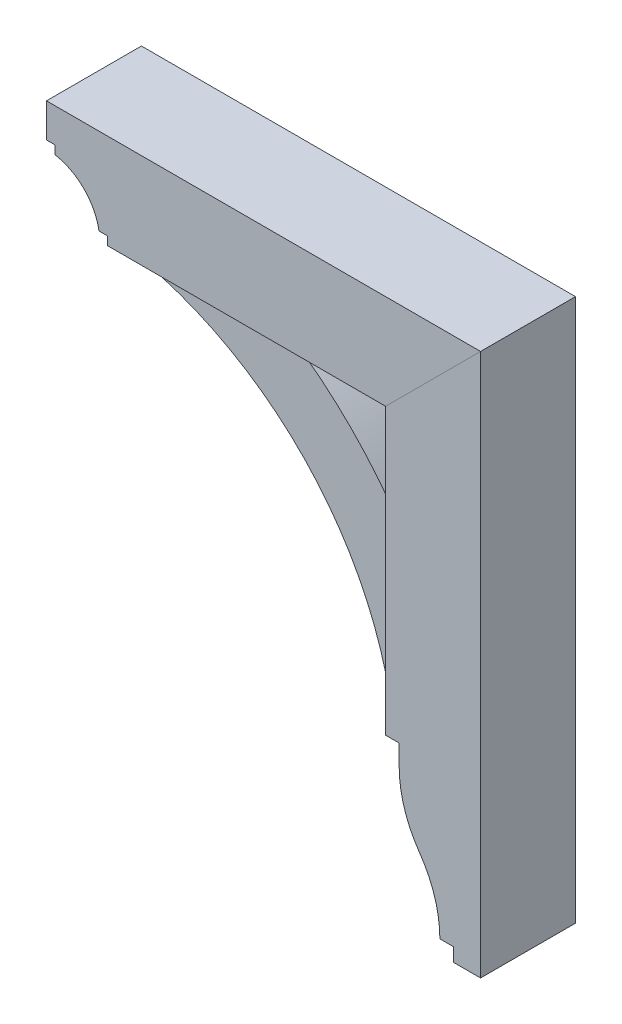
ISO-10303-21;
HEADER;
FILE_DESCRIPTION(('STEP AP214'),'2;1');
FILE_NAME('part.step','',(''),(''),'','','');
FILE_SCHEMA(('AUTOMOTIVE_DESIGN { 1 0 10303 214 1 1 1 1 }'));
ENDSEC;
DATA;
#1=APPLICATION_CONTEXT('core data for automotive mechanical design processes');
#2=APPLICATION_PROTOCOL_DEFINITION('international standard','automotive_design',2000,#1);
#3=PRODUCT_CONTEXT('',#1,'mechanical');
#4=PRODUCT('Part','Part','',(#3));
#5=PRODUCT_RELATED_PRODUCT_CATEGORY('part','',(#4));
#6=PRODUCT_DEFINITION_FORMATION('','',#4);
#7=PRODUCT_DEFINITION_CONTEXT('part definition',#1,'design');
#8=PRODUCT_DEFINITION('design','',#6,#7);
#9=PRODUCT_DEFINITION_SHAPE('','',#8);
#10=(LENGTH_UNIT() NAMED_UNIT(*) SI_UNIT(.MILLI.,.METRE.));
#11=(NAMED_UNIT(*) PLANE_ANGLE_UNIT() SI_UNIT($,.RADIAN.));
#12=(NAMED_UNIT(*) SI_UNIT($,.STERADIAN.) SOLID_ANGLE_UNIT());
#13=UNCERTAINTY_MEASURE_WITH_UNIT(LENGTH_MEASURE(1.E-05),#10,'distance_accuracy_value','');
#14=(GEOMETRIC_REPRESENTATION_CONTEXT(3) GLOBAL_UNCERTAINTY_ASSIGNED_CONTEXT((#13)) GLOBAL_UNIT_ASSIGNED_CONTEXT((#10,
#11,#12)) REPRESENTATION_CONTEXT('',''));
#15=CARTESIAN_POINT('',(0.,0.,0.));
#16=DIRECTION('',(0.,0.,1.));
#17=DIRECTION('',(1.,0.,0.));
#18=AXIS2_PLACEMENT_3D('',#15,#16,#17);
#19=CARTESIAN_POINT('',(246.881223015557,-1.43880954403931E-12,44.45));
#20=DIRECTION('',(1.,0.,0.));
#21=DIRECTION('',(0.,1.,0.));
#22=AXIS2_PLACEMENT_3D('',#19,#20,#21);
#23=PLANE('',#22);
#24=DIRECTION('',(0.,-1.,0.));
#25=VECTOR('',#24,1.);
#26=CARTESIAN_POINT('',(246.881223015557,-1.43880954403931E-12,-44.45));
#27=LINE('',#26,#25);
#28=CARTESIAN_POINT('',(246.881223015556,-183.515,-44.45));
#29=VERTEX_POINT('',#28);
#30=CARTESIAN_POINT('',(246.881223015556,-202.565,-44.45));
#31=VERTEX_POINT('',#30);
#32=EDGE_CURVE('E160',#29,#31,#27,.T.);
#33=ORIENTED_EDGE('',*,*,#32,.T.);
#34=DIRECTION('',(0.,0.,-1.));
#35=VECTOR('',#34,1.);
#36=CARTESIAN_POINT('',(246.881223015556,-202.565,44.45));
#37=LINE('',#36,#35);
#38=CARTESIAN_POINT('',(246.881223015556,-202.565,44.45));
#39=VERTEX_POINT('',#38);
#40=EDGE_CURVE('E12',#39,#31,#37,.T.);
#41=ORIENTED_EDGE('',*,*,#40,.F.);
#42=DIRECTION('',(0.,-1.,0.));
#43=VECTOR('',#42,1.);
#44=CARTESIAN_POINT('',(246.881223015557,-1.43880954403931E-12,44.45));
#45=LINE('',#44,#43);
#46=CARTESIAN_POINT('',(246.881223015556,-183.515,44.45));
#47=VERTEX_POINT('',#46);
#48=EDGE_CURVE('E183',#47,#39,#45,.T.);
#49=ORIENTED_EDGE('',*,*,#48,.F.);
#50=DIRECTION('',(0.,0.,-1.));
#51=VECTOR('',#50,1.);
#52=CARTESIAN_POINT('',(246.881223015556,-183.515,44.45));
#53=LINE('',#52,#51);
#54=EDGE_CURVE('E156',#47,#29,#53,.T.);
#55=ORIENTED_EDGE('',*,*,#54,.T.);
#56=EDGE_LOOP('',(#33,#41,#49,#55));
#57=FACE_BOUND('',#56,.T.);
#58=ADVANCED_FACE('F51',(#57),#23,.F.);
#59=CARTESIAN_POINT('',(351.656223015556,-202.565,44.45));
#60=DIRECTION('',(0.,0.,-1.));
#61=DIRECTION('',(-1.,0.,0.));
#62=AXIS2_PLACEMENT_3D('',#59,#60,#61);
#63=CYLINDRICAL_SURFACE('',#62,104.775);
#64=CARTESIAN_POINT('',(351.656223015556,-202.565,-44.45));
#65=DIRECTION('',(0.,0.,1.));
#66=DIRECTION('',(1.,0.,0.));
#67=AXIS2_PLACEMENT_3D('',#64,#65,#66);
#68=CIRCLE('',#67,104.775);
#69=CARTESIAN_POINT('',(265.883238128905,-262.738047858941,-44.45));
#70=VERTEX_POINT('',#69);
#71=EDGE_CURVE('E163',#31,#70,#68,.T.);
#72=ORIENTED_EDGE('',*,*,#71,.T.);
#73=DIRECTION('',(0.,0.,-1.));
#74=VECTOR('',#73,1.);
#75=CARTESIAN_POINT('',(265.883238128905,-262.738047858941,44.45));
#76=LINE('',#75,#74);
#77=CARTESIAN_POINT('',(265.883238128905,-262.738047858941,44.45));
#78=VERTEX_POINT('',#77);
#79=EDGE_CURVE('E59',#78,#70,#76,.T.);
#80=ORIENTED_EDGE('',*,*,#79,.F.);
#81=CARTESIAN_POINT('',(351.656223015556,-202.565,44.45));
#82=DIRECTION('',(0.,0.,1.));
#83=DIRECTION('',(1.,0.,0.));
#84=AXIS2_PLACEMENT_3D('',#81,#82,#83);
#85=CIRCLE('',#84,104.775);
#86=EDGE_CURVE('E116',#39,#78,#85,.T.);
#87=ORIENTED_EDGE('',*,*,#86,.F.);
#88=ORIENTED_EDGE('',*,*,#40,.T.);
#89=EDGE_LOOP('',(#72,#80,#87,#88));
#90=FACE_BOUND('',#89,.T.);
#91=ADVANCED_FACE('F200',(#90),#63,.T.);
#92=CARTESIAN_POINT('',(179.677056348883,-323.215,44.45));
#93=DIRECTION('',(0.,0.,-1.));
#94=DIRECTION('',(-1.,0.,0.));
#95=AXIS2_PLACEMENT_3D('',#92,#93,#94);
#96=CYLINDRICAL_SURFACE('',#95,105.304166666672);
#97=CARTESIAN_POINT('',(179.677056348883,-323.215,-44.45));
#98=DIRECTION('',(0.,0.,1.));
#99=DIRECTION('',(1.,0.,0.));
#100=AXIS2_PLACEMENT_3D('',#97,#98,#99);
#101=CIRCLE('',#100,105.304166666672);
#102=CARTESIAN_POINT('',(284.981223015555,-323.215,-44.45));
#103=VERTEX_POINT('',#102);
#104=EDGE_CURVE('E166',#103,#70,#101,.T.);
#105=ORIENTED_EDGE('',*,*,#104,.F.);
#106=DIRECTION('',(0.,0.,-1.));
#107=VECTOR('',#106,1.);
#108=CARTESIAN_POINT('',(284.981223015555,-323.215,44.45));
#109=LINE('',#108,#107);
#110=CARTESIAN_POINT('',(284.981223015555,-323.215,44.45));
#111=VERTEX_POINT('',#110);
#112=EDGE_CURVE('E193',#111,#103,#109,.T.);
#113=ORIENTED_EDGE('',*,*,#112,.F.);
#114=CARTESIAN_POINT('',(179.677056348883,-323.215,44.45));
#115=DIRECTION('',(0.,0.,1.));
#116=DIRECTION('',(1.,0.,0.));
#117=AXIS2_PLACEMENT_3D('',#114,#115,#116);
#118=CIRCLE('',#117,105.304166666672);
#119=EDGE_CURVE('E199',#111,#78,#118,.T.);
#120=ORIENTED_EDGE('',*,*,#119,.T.);
#121=ORIENTED_EDGE('',*,*,#79,.T.);
#122=EDGE_LOOP('',(#105,#113,#120,#121));
#123=FACE_BOUND('',#122,.T.);
#124=ADVANCED_FACE('F197',(#123),#96,.F.);
#125=CARTESIAN_POINT('',(0.,-323.215,44.45));
#126=DIRECTION('',(0.,-1.,0.));
#127=DIRECTION('',(0.,0.,-1.));
#128=AXIS2_PLACEMENT_3D('',#125,#126,#127);
#129=PLANE('',#128);
#130=DIRECTION('',(-1.,0.,0.));
#131=VECTOR('',#130,1.);
#132=CARTESIAN_POINT('',(0.,-323.215,-44.45));
#133=LINE('',#132,#131);
#134=CARTESIAN_POINT('',(297.681223015555,-323.215,-44.45));
#135=VERTEX_POINT('',#134);
#136=EDGE_CURVE('E169',#135,#103,#133,.T.);
#137=ORIENTED_EDGE('',*,*,#136,.F.);
#138=DIRECTION('',(0.,0.,-1.));
#139=VECTOR('',#138,1.);
#140=CARTESIAN_POINT('',(297.681223015555,-323.215,44.45));
#141=LINE('',#140,#139);
#142=CARTESIAN_POINT('',(297.681223015555,-323.215,44.45));
#143=VERTEX_POINT('',#142);
#144=EDGE_CURVE('E191',#143,#135,#141,.T.);
#145=ORIENTED_EDGE('',*,*,#144,.F.);
#146=DIRECTION('',(-1.,0.,0.));
#147=VECTOR('',#146,1.);
#148=CARTESIAN_POINT('',(0.,-323.215,44.45));
#149=LINE('',#148,#147);
#150=EDGE_CURVE('E211',#143,#111,#149,.T.);
#151=ORIENTED_EDGE('',*,*,#150,.T.);
#152=ORIENTED_EDGE('',*,*,#112,.T.);
#153=EDGE_LOOP('',(#137,#145,#151,#152));
#154=FACE_BOUND('',#153,.T.);
#155=ADVANCED_FACE('F208',(#154),#129,.T.);
#156=CARTESIAN_POINT('',(297.681223015555,0.,44.45));
#157=DIRECTION('',(-1.,0.,0.));
#158=DIRECTION('',(0.,0.,1.));
#159=AXIS2_PLACEMENT_3D('',#156,#157,#158);
#160=PLANE('',#159);
#161=DIRECTION('',(0.,1.,0.));
#162=VECTOR('',#161,1.);
#163=CARTESIAN_POINT('',(297.681223015555,0.,-44.45));
#164=LINE('',#163,#162);
#165=CARTESIAN_POINT('',(297.681223015555,-335.915,-44.45));
#166=VERTEX_POINT('',#165);
#167=EDGE_CURVE('E172',#166,#135,#164,.T.);
#168=ORIENTED_EDGE('',*,*,#167,.F.);
#169=DIRECTION('',(0.,0.,-1.));
#170=VECTOR('',#169,1.);
#171=CARTESIAN_POINT('',(297.681223015555,-335.915,44.45));
#172=LINE('',#171,#170);
#173=CARTESIAN_POINT('',(297.681223015555,-335.915,44.45));
#174=VERTEX_POINT('',#173);
#175=EDGE_CURVE('E189',#174,#166,#172,.T.);
#176=ORIENTED_EDGE('',*,*,#175,.F.);
#177=DIRECTION('',(0.,1.,0.));
#178=VECTOR('',#177,1.);
#179=CARTESIAN_POINT('',(297.681223015555,0.,44.45));
#180=LINE('',#179,#178);
#181=EDGE_CURVE('E215',#174,#143,#180,.T.);
#182=ORIENTED_EDGE('',*,*,#181,.T.);
#183=ORIENTED_EDGE('',*,*,#144,.T.);
#184=EDGE_LOOP('',(#168,#176,#182,#183));
#185=FACE_BOUND('',#184,.T.);
#186=ADVANCED_FACE('F227',(#185),#160,.T.);
#187=CARTESIAN_POINT('',(7.34134975033387E-13,-335.915000000001,44.45));
#188=DIRECTION('',(0.,-1.,0.));
#189=DIRECTION('',(1.,0.,0.));
#190=AXIS2_PLACEMENT_3D('',#187,#188,#189);
#191=PLANE('',#190);
#192=DIRECTION('',(-1.,0.,0.));
#193=VECTOR('',#192,1.);
#194=CARTESIAN_POINT('',(7.34134975033387E-13,-335.915000000001,-44.45));
#195=LINE('',#194,#193);
#196=CARTESIAN_POINT('',(323.081223015555,-335.915,-44.45));
#197=VERTEX_POINT('',#196);
#198=EDGE_CURVE('E175',#197,#166,#195,.T.);
#199=ORIENTED_EDGE('',*,*,#198,.F.);
#200=DIRECTION('',(0.,0.,-1.));
#201=VECTOR('',#200,1.);
#202=CARTESIAN_POINT('',(323.081223015555,-335.915,44.45));
#203=LINE('',#202,#201);
#204=CARTESIAN_POINT('',(323.081223015555,-335.915,44.45));
#205=VERTEX_POINT('',#204);
#206=EDGE_CURVE('E187',#205,#197,#203,.T.);
#207=ORIENTED_EDGE('',*,*,#206,.F.);
#208=DIRECTION('',(-1.,0.,0.));
#209=VECTOR('',#208,1.);
#210=CARTESIAN_POINT('',(7.34134975033387E-13,-335.915000000001,44.45));
#211=LINE('',#210,#209);
#212=EDGE_CURVE('E221',#205,#174,#211,.T.);
#213=ORIENTED_EDGE('',*,*,#212,.T.);
#214=ORIENTED_EDGE('',*,*,#175,.T.);
#215=EDGE_LOOP('',(#199,#207,#213,#214));
#216=FACE_BOUND('',#215,.T.);
#217=ADVANCED_FACE('F225',(#216),#191,.T.);
#218=CARTESIAN_POINT('',(323.081223015555,0.,44.45));
#219=DIRECTION('',(-1.,0.,0.));
#220=DIRECTION('',(0.,0.,1.));
#221=AXIS2_PLACEMENT_3D('',#218,#219,#220);
#222=PLANE('',#221);
#223=DIRECTION('',(0.,1.,0.));
#224=VECTOR('',#223,1.);
#225=CARTESIAN_POINT('',(323.081223015555,0.,-44.45));
#226=LINE('',#225,#224);
#227=CARTESIAN_POINT('',(323.081223015555,172.085,-44.45));
#228=VERTEX_POINT('',#227);
#229=EDGE_CURVE('E178',#197,#228,#226,.T.);
#230=ORIENTED_EDGE('',*,*,#229,.T.);
#231=DIRECTION('',(0.,0.,-1.));
#232=VECTOR('',#231,1.);
#233=CARTESIAN_POINT('',(323.081223015555,172.085,44.45));
#234=LINE('',#233,#232);
#235=CARTESIAN_POINT('',(323.081223015555,172.085,44.45));
#236=VERTEX_POINT('',#235);
#237=EDGE_CURVE('E151',#236,#228,#234,.T.);
#238=ORIENTED_EDGE('',*,*,#237,.F.);
#239=DIRECTION('',(0.,1.,0.));
#240=VECTOR('',#239,1.);
#241=CARTESIAN_POINT('',(323.081223015555,0.,44.45));
#242=LINE('',#241,#240);
#243=EDGE_CURVE('E142',#205,#236,#242,.T.);
#244=ORIENTED_EDGE('',*,*,#243,.F.);
#245=ORIENTED_EDGE('',*,*,#206,.T.);
#246=EDGE_LOOP('',(#230,#238,#244,#245));
#247=FACE_BOUND('',#246,.T.);
#248=ADVANCED_FACE('F230',(#247),#222,.F.);
#249=CARTESIAN_POINT('',(75.4981115077795,-75.4981115077785,44.45));
#250=DIRECTION('',(0.707106781186552,-0.707106781186543,0.));
#251=DIRECTION('',(0.707106781186543,0.707106781186552,0.));
#252=AXIS2_PLACEMENT_3D('',#249,#250,#251);
#253=PLANE('',#252);
#254=DIRECTION('',(-0.707106781186543,-0.707106781186552,0.));
#255=VECTOR('',#254,1.);
#256=CARTESIAN_POINT('',(75.4981115077795,-75.4981115077785,-44.45));
#257=LINE('',#256,#255);
#258=CARTESIAN_POINT('',(234.181223015556,83.1849999999999,-44.45));
#259=VERTEX_POINT('',#258);
#260=EDGE_CURVE('E150',#228,#259,#257,.T.);
#261=ORIENTED_EDGE('',*,*,#260,.T.);
#262=DIRECTION('',(0.,0.,-1.));
#263=VECTOR('',#262,1.);
#264=CARTESIAN_POINT('',(234.181223015556,83.1849999999999,44.45));
#265=LINE('',#264,#263);
#266=CARTESIAN_POINT('',(234.181223015556,83.1849999999999,44.45));
#267=VERTEX_POINT('',#266);
#268=EDGE_CURVE('E147',#267,#259,#265,.T.);
#269=ORIENTED_EDGE('',*,*,#268,.F.);
#270=DIRECTION('',(-0.707106781186543,-0.707106781186552,0.));
#271=VECTOR('',#270,1.);
#272=CARTESIAN_POINT('',(75.4981115077795,-75.4981115077785,44.45));
#273=LINE('',#272,#271);
#274=EDGE_CURVE('E135',#236,#267,#273,.T.);
#275=ORIENTED_EDGE('',*,*,#274,.F.);
#276=ORIENTED_EDGE('',*,*,#237,.T.);
#277=EDGE_LOOP('',(#261,#269,#275,#276));
#278=FACE_BOUND('',#277,.T.);
#279=ADVANCED_FACE('F148',(#278),#253,.F.);
#280=CARTESIAN_POINT('',(234.181223015556,0.,44.45));
#281=DIRECTION('',(1.,0.,0.));
#282=DIRECTION('',(0.,1.,0.));
#283=AXIS2_PLACEMENT_3D('',#280,#281,#282);
#284=PLANE('',#283);
#285=DIRECTION('',(0.,-1.,0.));
#286=VECTOR('',#285,1.);
#287=CARTESIAN_POINT('',(234.181223015556,0.,-44.45));
#288=LINE('',#287,#286);
#289=CARTESIAN_POINT('',(234.181223015556,-183.515,-44.45));
#290=VERTEX_POINT('',#289);
#291=EDGE_CURVE('E102',#259,#290,#288,.T.);
#292=ORIENTED_EDGE('',*,*,#291,.T.);
#293=DIRECTION('',(0.,0.,-1.));
#294=VECTOR('',#293,1.);
#295=CARTESIAN_POINT('',(234.181223015556,-183.515,44.45));
#296=LINE('',#295,#294);
#297=CARTESIAN_POINT('',(234.181223015556,-183.515,44.45));
#298=VERTEX_POINT('',#297);
#299=EDGE_CURVE('E152',#298,#290,#296,.T.);
#300=ORIENTED_EDGE('',*,*,#299,.F.);
#301=DIRECTION('',(0.,-1.,0.));
#302=VECTOR('',#301,1.);
#303=CARTESIAN_POINT('',(234.181223015556,0.,44.45));
#304=LINE('',#303,#302);
#305=EDGE_CURVE('E139',#267,#298,#304,.T.);
#306=ORIENTED_EDGE('',*,*,#305,.F.);
#307=ORIENTED_EDGE('',*,*,#268,.T.);
#308=EDGE_LOOP('',(#292,#300,#306,#307));
#309=FACE_BOUND('',#308,.T.);
#310=ADVANCED_FACE('F154',(#309),#284,.F.);
#311=CARTESIAN_POINT('',(0.,-183.515,44.45));
#312=DIRECTION('',(0.,1.,0.));
#313=DIRECTION('',(0.,0.,1.));
#314=AXIS2_PLACEMENT_3D('',#311,#312,#313);
#315=PLANE('',#314);
#316=DIRECTION('',(1.,0.,0.));
#317=VECTOR('',#316,1.);
#318=CARTESIAN_POINT('',(0.,-183.515,-44.45));
#319=LINE('',#318,#317);
#320=EDGE_CURVE('E108',#290,#29,#319,.T.);
#321=ORIENTED_EDGE('',*,*,#320,.T.);
#322=ORIENTED_EDGE('',*,*,#54,.F.);
#323=DIRECTION('',(1.,0.,0.));
#324=VECTOR('',#323,1.);
#325=CARTESIAN_POINT('',(0.,-183.515,44.45));
#326=LINE('',#325,#324);
#327=EDGE_CURVE('E67',#298,#47,#326,.T.);
#328=ORIENTED_EDGE('',*,*,#327,.F.);
#329=ORIENTED_EDGE('',*,*,#299,.T.);
#330=EDGE_LOOP('',(#321,#322,#328,#329));
#331=FACE_BOUND('',#330,.T.);
#332=ADVANCED_FACE('F245',(#331),#315,.F.);
#333=CARTESIAN_POINT('',(0.,0.,44.45));
#334=DIRECTION('',(0.,0.,1.));
#335=DIRECTION('',(1.,0.,0.));
#336=AXIS2_PLACEMENT_3D('',#333,#334,#335);
#337=PLANE('',#336);
#338=ORIENTED_EDGE('',*,*,#48,.T.);
#339=ORIENTED_EDGE('',*,*,#86,.T.);
#340=ORIENTED_EDGE('',*,*,#119,.F.);
#341=ORIENTED_EDGE('',*,*,#150,.F.);
#342=ORIENTED_EDGE('',*,*,#181,.F.);
#343=ORIENTED_EDGE('',*,*,#212,.F.);
#344=ORIENTED_EDGE('',*,*,#243,.T.);
#345=ORIENTED_EDGE('',*,*,#274,.T.);
#346=ORIENTED_EDGE('',*,*,#305,.T.);
#347=ORIENTED_EDGE('',*,*,#327,.T.);
#348=EDGE_LOOP('',(#338,#339,#340,#341,#342,#343,#344,#345,#346,#347));
#349=FACE_BOUND('',#348,.T.);
#350=ADVANCED_FACE('F137',(#349),#337,.T.);
#351=CARTESIAN_POINT('',(0.,0.,-44.45));
#352=DIRECTION('',(0.,0.,1.));
#353=DIRECTION('',(1.,0.,0.));
#354=AXIS2_PLACEMENT_3D('',#351,#352,#353);
#355=PLANE('',#354);
#356=ORIENTED_EDGE('',*,*,#32,.F.);
#357=ORIENTED_EDGE('',*,*,#320,.F.);
#358=ORIENTED_EDGE('',*,*,#291,.F.);
#359=ORIENTED_EDGE('',*,*,#260,.F.);
#360=ORIENTED_EDGE('',*,*,#229,.F.);
#361=ORIENTED_EDGE('',*,*,#198,.T.);
#362=ORIENTED_EDGE('',*,*,#167,.T.);
#363=ORIENTED_EDGE('',*,*,#136,.T.);
#364=ORIENTED_EDGE('',*,*,#104,.T.);
#365=ORIENTED_EDGE('',*,*,#71,.F.);
#366=EDGE_LOOP('',(#356,#357,#358,#359,#360,#361,#362,#363,#364,#365));
#367=FACE_BOUND('',#366,.T.);
#368=ADVANCED_FACE('F204',(#367),#355,.F.);
#369=CLOSED_SHELL('',(#58,#91,#124,#155,#186,#217,#248,#279,#310,#332,#350,#368));
#370=MANIFOLD_SOLID_BREP('B2',#369);
#371=CARTESIAN_POINT('',(-72.0435310706523,-223.039754086208,31.75));
#372=DIRECTION('',(0.,0.,-1.));
#373=DIRECTION('',(-1.,0.,0.));
#374=AXIS2_PLACEMENT_3D('',#371,#372,#373);
#375=CYLINDRICAL_SURFACE('',#374,368.3);
#376=CARTESIAN_POINT('',(-72.0435310706523,-223.039754086208,-31.75));
#377=DIRECTION('',(0.,0.,1.));
#378=DIRECTION('',(1.,0.,0.));
#379=AXIS2_PLACEMENT_3D('',#376,#377,#378);
#380=CIRCLE('',#379,368.3);
#381=CARTESIAN_POINT('',(132.581223015556,83.1849999999999,-31.75));
#382=VERTEX_POINT('',#381);
#383=CARTESIAN_POINT('',(234.181223015556,-18.4150000000001,-31.75));
#384=VERTEX_POINT('',#383);
#385=EDGE_CURVE('E421',#382,#384,#380,.F.);
#386=ORIENTED_EDGE('',*,*,#385,.F.);
#387=DIRECTION('',(0.,0.,-1.));
#388=VECTOR('',#387,1.);
#389=CARTESIAN_POINT('',(132.581223015556,83.1849999999999,31.75));
#390=LINE('',#389,#388);
#391=CARTESIAN_POINT('',(132.581223015556,83.1849999999999,31.75));
#392=VERTEX_POINT('',#391);
#393=EDGE_CURVE('E49',#392,#382,#390,.T.);
#394=ORIENTED_EDGE('',*,*,#393,.F.);
#395=CARTESIAN_POINT('',(-72.0435310706523,-223.039754086208,31.75));
#396=DIRECTION('',(0.,0.,1.));
#397=DIRECTION('',(1.,0.,0.));
#398=AXIS2_PLACEMENT_3D('',#395,#396,#397);
#399=CIRCLE('',#398,368.3);
#400=CARTESIAN_POINT('',(234.181223015556,-18.4150000000001,31.75));
#401=VERTEX_POINT('',#400);
#402=EDGE_CURVE('E434',#392,#401,#399,.F.);
#403=ORIENTED_EDGE('',*,*,#402,.T.);
#404=DIRECTION('',(0.,0.,-1.));
#405=VECTOR('',#404,1.);
#406=CARTESIAN_POINT('',(234.181223015556,-18.4150000000001,31.75));
#407=LINE('',#406,#405);
#408=EDGE_CURVE('E355',#401,#384,#407,.T.);
#409=ORIENTED_EDGE('',*,*,#408,.T.);
#410=EDGE_LOOP('',(#386,#394,#403,#409));
#411=FACE_BOUND('',#410,.T.);
#412=ADVANCED_FACE('F339',(#411),#375,.T.);
#413=CARTESIAN_POINT('',(0.,83.1849999999999,31.75));
#414=DIRECTION('',(0.,1.,0.));
#415=DIRECTION('',(0.,0.,1.));
#416=AXIS2_PLACEMENT_3D('',#413,#414,#415);
#417=PLANE('',#416);
#418=DIRECTION('',(1.,0.,0.));
#419=VECTOR('',#418,1.);
#420=CARTESIAN_POINT('',(0.,83.1849999999999,-31.75));
#421=LINE('',#420,#419);
#422=CARTESIAN_POINT('',(11.9312230155549,83.1849999999999,-31.75));
#423=VERTEX_POINT('',#422);
#424=EDGE_CURVE('E423',#423,#382,#421,.T.);
#425=ORIENTED_EDGE('',*,*,#424,.F.);
#426=DIRECTION('',(0.,0.,-1.));
#427=VECTOR('',#426,1.);
#428=CARTESIAN_POINT('',(11.9312230155549,83.1849999999999,31.75));
#429=LINE('',#428,#427);
#430=CARTESIAN_POINT('',(11.9312230155549,83.1849999999999,31.75));
#431=VERTEX_POINT('',#430);
#432=EDGE_CURVE('E347',#431,#423,#429,.T.);
#433=ORIENTED_EDGE('',*,*,#432,.F.);
#434=DIRECTION('',(1.,0.,0.));
#435=VECTOR('',#434,1.);
#436=CARTESIAN_POINT('',(0.,83.1849999999999,31.75));
#437=LINE('',#436,#435);
#438=EDGE_CURVE('E446',#431,#392,#437,.T.);
#439=ORIENTED_EDGE('',*,*,#438,.T.);
#440=ORIENTED_EDGE('',*,*,#393,.T.);
#441=EDGE_LOOP('',(#425,#433,#439,#440));
#442=FACE_BOUND('',#441,.T.);
#443=ADVANCED_FACE('F445',(#442),#417,.T.);
#444=CARTESIAN_POINT('',(11.9312230155549,0.,31.75));
#445=DIRECTION('',(1.,0.,0.));
#446=DIRECTION('',(0.,1.,0.));
#447=AXIS2_PLACEMENT_3D('',#444,#445,#446);
#448=PLANE('',#447);
#449=DIRECTION('',(0.,-1.,0.));
#450=VECTOR('',#449,1.);
#451=CARTESIAN_POINT('',(11.9312230155549,0.,-31.75));
#452=LINE('',#451,#450);
#453=CARTESIAN_POINT('',(11.9312230155549,70.4849999999999,-31.75));
#454=VERTEX_POINT('',#453);
#455=EDGE_CURVE('E426',#423,#454,#452,.T.);
#456=ORIENTED_EDGE('',*,*,#455,.T.);
#457=DIRECTION('',(0.,0.,-1.));
#458=VECTOR('',#457,1.);
#459=CARTESIAN_POINT('',(11.9312230155549,70.4849999999999,31.75));
#460=LINE('',#459,#458);
#461=CARTESIAN_POINT('',(11.9312230155549,70.4849999999999,31.75));
#462=VERTEX_POINT('',#461);
#463=EDGE_CURVE('E413',#462,#454,#460,.T.);
#464=ORIENTED_EDGE('',*,*,#463,.F.);
#465=DIRECTION('',(0.,-1.,0.));
#466=VECTOR('',#465,1.);
#467=CARTESIAN_POINT('',(11.9312230155549,0.,31.75));
#468=LINE('',#467,#466);
#469=EDGE_CURVE('E401',#431,#462,#468,.T.);
#470=ORIENTED_EDGE('',*,*,#469,.F.);
#471=ORIENTED_EDGE('',*,*,#432,.T.);
#472=EDGE_LOOP('',(#456,#464,#470,#471));
#473=FACE_BOUND('',#472,.T.);
#474=ADVANCED_FACE('F439',(#473),#448,.F.);
#475=CARTESIAN_POINT('',(-73.516334045698,-222.092775971218,31.75));
#476=DIRECTION('',(0.,0.,-1.));
#477=DIRECTION('',(-1.,0.,0.));
#478=AXIS2_PLACEMENT_3D('',#475,#476,#477);
#479=CYLINDRICAL_SURFACE('',#478,304.8);
#480=CARTESIAN_POINT('',(-73.516334045698,-222.092775971218,-31.75));
#481=DIRECTION('',(0.,0.,1.));
#482=DIRECTION('',(1.,0.,0.));
#483=AXIS2_PLACEMENT_3D('',#480,#481,#482);
#484=CIRCLE('',#483,304.8);
#485=CARTESIAN_POINT('',(221.481223015556,-145.415,-31.75));
#486=VERTEX_POINT('',#485);
#487=EDGE_CURVE('E410',#454,#486,#484,.F.);
#488=ORIENTED_EDGE('',*,*,#487,.T.);
#489=DIRECTION('',(0.,0.,-1.));
#490=VECTOR('',#489,1.);
#491=CARTESIAN_POINT('',(221.481223015556,-145.415,31.75));
#492=LINE('',#491,#490);
#493=CARTESIAN_POINT('',(221.481223015556,-145.415,31.75));
#494=VERTEX_POINT('',#493);
#495=EDGE_CURVE('E407',#494,#486,#492,.T.);
#496=ORIENTED_EDGE('',*,*,#495,.F.);
#497=CARTESIAN_POINT('',(-73.516334045698,-222.092775971218,31.75));
#498=DIRECTION('',(0.,0.,1.));
#499=DIRECTION('',(1.,0.,0.));
#500=AXIS2_PLACEMENT_3D('',#497,#498,#499);
#501=CIRCLE('',#500,304.8);
#502=EDGE_CURVE('E393',#462,#494,#501,.F.);
#503=ORIENTED_EDGE('',*,*,#502,.F.);
#504=ORIENTED_EDGE('',*,*,#463,.T.);
#505=EDGE_LOOP('',(#488,#496,#503,#504));
#506=FACE_BOUND('',#505,.T.);
#507=ADVANCED_FACE('F408',(#506),#479,.F.);
#508=CARTESIAN_POINT('',(3.17801340798953E-13,-145.415000000001,31.75));
#509=DIRECTION('',(0.,-1.,0.));
#510=DIRECTION('',(1.,0.,0.));
#511=AXIS2_PLACEMENT_3D('',#508,#509,#510);
#512=PLANE('',#511);
#513=DIRECTION('',(-1.,0.,0.));
#514=VECTOR('',#513,1.);
#515=CARTESIAN_POINT('',(3.17801340798953E-13,-145.415000000001,-31.75));
#516=LINE('',#515,#514);
#517=CARTESIAN_POINT('',(234.181223015556,-145.415,-31.75));
#518=VERTEX_POINT('',#517);
#519=EDGE_CURVE('E429',#518,#486,#516,.T.);
#520=ORIENTED_EDGE('',*,*,#519,.F.);
#521=DIRECTION('',(0.,0.,-1.));
#522=VECTOR('',#521,1.);
#523=CARTESIAN_POINT('',(234.181223015556,-145.415,31.75));
#524=LINE('',#523,#522);
#525=CARTESIAN_POINT('',(234.181223015556,-145.415,31.75));
#526=VERTEX_POINT('',#525);
#527=EDGE_CURVE('E374',#526,#518,#524,.T.);
#528=ORIENTED_EDGE('',*,*,#527,.F.);
#529=DIRECTION('',(-1.,0.,0.));
#530=VECTOR('',#529,1.);
#531=CARTESIAN_POINT('',(3.17801340798953E-13,-145.415000000001,31.75));
#532=LINE('',#531,#530);
#533=EDGE_CURVE('E398',#526,#494,#532,.T.);
#534=ORIENTED_EDGE('',*,*,#533,.T.);
#535=ORIENTED_EDGE('',*,*,#495,.T.);
#536=EDGE_LOOP('',(#520,#528,#534,#535));
#537=FACE_BOUND('',#536,.T.);
#538=ADVANCED_FACE('F415',(#537),#512,.T.);
#539=CARTESIAN_POINT('',(234.181223015556,0.,31.75));
#540=DIRECTION('',(1.,0.,0.));
#541=DIRECTION('',(0.,1.,0.));
#542=AXIS2_PLACEMENT_3D('',#539,#540,#541);
#543=PLANE('',#542);
#544=DIRECTION('',(0.,-1.,0.));
#545=VECTOR('',#544,1.);
#546=CARTESIAN_POINT('',(234.181223015556,0.,-31.75));
#547=LINE('',#546,#545);
#548=EDGE_CURVE('E431',#384,#518,#547,.T.);
#549=ORIENTED_EDGE('',*,*,#548,.F.);
#550=ORIENTED_EDGE('',*,*,#408,.F.);
#551=DIRECTION('',(0.,-1.,0.));
#552=VECTOR('',#551,1.);
#553=CARTESIAN_POINT('',(234.181223015556,0.,31.75));
#554=LINE('',#553,#552);
#555=EDGE_CURVE('E416',#401,#526,#554,.T.);
#556=ORIENTED_EDGE('',*,*,#555,.T.);
#557=ORIENTED_EDGE('',*,*,#527,.T.);
#558=EDGE_LOOP('',(#549,#550,#556,#557));
#559=FACE_BOUND('',#558,.T.);
#560=ADVANCED_FACE('F447',(#559),#543,.T.);
#561=CARTESIAN_POINT('',(0.,0.,31.75));
#562=DIRECTION('',(0.,0.,1.));
#563=DIRECTION('',(1.,0.,0.));
#564=AXIS2_PLACEMENT_3D('',#561,#562,#563);
#565=PLANE('',#564);
#566=ORIENTED_EDGE('',*,*,#402,.F.);
#567=ORIENTED_EDGE('',*,*,#438,.F.);
#568=ORIENTED_EDGE('',*,*,#469,.T.);
#569=ORIENTED_EDGE('',*,*,#502,.T.);
#570=ORIENTED_EDGE('',*,*,#533,.F.);
#571=ORIENTED_EDGE('',*,*,#555,.F.);
#572=EDGE_LOOP('',(#566,#567,#568,#569,#570,#571));
#573=FACE_BOUND('',#572,.T.);
#574=ADVANCED_FACE('F395',(#573),#565,.T.);
#575=CARTESIAN_POINT('',(0.,0.,-31.75));
#576=DIRECTION('',(0.,0.,1.));
#577=DIRECTION('',(1.,0.,0.));
#578=AXIS2_PLACEMENT_3D('',#575,#576,#577);
#579=PLANE('',#578);
#580=ORIENTED_EDGE('',*,*,#385,.T.);
#581=ORIENTED_EDGE('',*,*,#548,.T.);
#582=ORIENTED_EDGE('',*,*,#519,.T.);
#583=ORIENTED_EDGE('',*,*,#487,.F.);
#584=ORIENTED_EDGE('',*,*,#455,.F.);
#585=ORIENTED_EDGE('',*,*,#424,.T.);
#586=EDGE_LOOP('',(#580,#581,#582,#583,#584,#585));
#587=FACE_BOUND('',#586,.T.);
#588=ADVANCED_FACE('F444',(#587),#579,.F.);
#589=CLOSED_SHELL('',(#412,#443,#474,#507,#538,#560,#574,#588));
#590=MANIFOLD_SOLID_BREP('B6',#589);
#591=CARTESIAN_POINT('',(-75.3812769844454,1.31795321785477E-13,44.45));
#592=DIRECTION('',(-1.,0.,0.));
#593=DIRECTION('',(0.,-1.,0.));
#594=AXIS2_PLACEMENT_3D('',#591,#592,#593);
#595=PLANE('',#594);
#596=DIRECTION('',(0.,1.,0.));
#597=VECTOR('',#596,1.);
#598=CARTESIAN_POINT('',(-75.3812769844454,1.31795321785477E-13,-44.45));
#599=LINE('',#598,#597);
#600=CARTESIAN_POINT('',(-75.3812769844451,132.3975,-44.45));
#601=VERTEX_POINT('',#600);
#602=CARTESIAN_POINT('',(-75.3812769844451,140.335,-44.45));
#603=VERTEX_POINT('',#602);
#604=EDGE_CURVE('E613',#601,#603,#599,.T.);
#605=ORIENTED_EDGE('',*,*,#604,.F.);
#606=DIRECTION('',(0.,0.,-1.));
#607=VECTOR('',#606,1.);
#608=CARTESIAN_POINT('',(-75.3812769844451,132.3975,44.45));
#609=LINE('',#608,#607);
#610=CARTESIAN_POINT('',(-75.3812769844451,132.3975,44.45));
#611=VERTEX_POINT('',#610);
#612=EDGE_CURVE('E337',#611,#601,#609,.T.);
#613=ORIENTED_EDGE('',*,*,#612,.F.);
#614=DIRECTION('',(0.,1.,0.));
#615=VECTOR('',#614,1.);
#616=CARTESIAN_POINT('',(-75.3812769844454,1.31795321785477E-13,44.45));
#617=LINE('',#616,#615);
#618=CARTESIAN_POINT('',(-75.3812769844451,140.335,44.45));
#619=VERTEX_POINT('',#618);
#620=EDGE_CURVE('E636',#611,#619,#617,.T.);
#621=ORIENTED_EDGE('',*,*,#620,.T.);
#622=DIRECTION('',(0.,0.,-1.));
#623=VECTOR('',#622,1.);
#624=CARTESIAN_POINT('',(-75.3812769844451,140.335,44.45));
#625=LINE('',#624,#623);
#626=EDGE_CURVE('E530',#619,#603,#625,.T.);
#627=ORIENTED_EDGE('',*,*,#626,.T.);
#628=EDGE_LOOP('',(#605,#613,#621,#627));
#629=FACE_BOUND('',#628,.T.);
#630=ADVANCED_FACE('F514',(#629),#595,.T.);
#631=CARTESIAN_POINT('',(-84.0871429736804,82.4166340107647,44.45));
#632=DIRECTION('',(0.,0.,-1.));
#633=DIRECTION('',(-1.,0.,0.));
#634=AXIS2_PLACEMENT_3D('',#631,#632,#633);
#635=CYLINDRICAL_SURFACE('',#634,50.7334117486339);
#636=CARTESIAN_POINT('',(-84.0871429736804,82.4166340107647,-44.45));
#637=DIRECTION('',(0.,0.,1.));
#638=DIRECTION('',(1.,0.,0.));
#639=AXIS2_PLACEMENT_3D('',#636,#637,#638);
#640=CIRCLE('',#639,50.7334117486339);
#641=CARTESIAN_POINT('',(-34.1062769844451,91.1224999999999,-44.45));
#642=VERTEX_POINT('',#641);
#643=EDGE_CURVE('E615',#601,#642,#640,.F.);
#644=ORIENTED_EDGE('',*,*,#643,.T.);
#645=DIRECTION('',(0.,0.,-1.));
#646=VECTOR('',#645,1.);
#647=CARTESIAN_POINT('',(-34.1062769844451,91.1224999999999,44.45));
#648=LINE('',#647,#646);
#649=CARTESIAN_POINT('',(-34.1062769844451,91.1224999999999,44.45));
#650=VERTEX_POINT('',#649);
#651=EDGE_CURVE('E522',#650,#642,#648,.T.);
#652=ORIENTED_EDGE('',*,*,#651,.F.);
#653=CARTESIAN_POINT('',(-84.0871429736804,82.4166340107647,44.45));
#654=DIRECTION('',(0.,0.,1.));
#655=DIRECTION('',(1.,0.,0.));
#656=AXIS2_PLACEMENT_3D('',#653,#654,#655);
#657=CIRCLE('',#656,50.7334117486339);
#658=EDGE_CURVE('E665',#611,#650,#657,.F.);
#659=ORIENTED_EDGE('',*,*,#658,.F.);
#660=ORIENTED_EDGE('',*,*,#612,.T.);
#661=EDGE_LOOP('',(#644,#652,#659,#660));
#662=FACE_BOUND('',#661,.T.);
#663=ADVANCED_FACE('F654',(#662),#635,.F.);
#664=CARTESIAN_POINT('',(0.,91.1224999999999,44.45));
#665=DIRECTION('',(0.,-1.,0.));
#666=DIRECTION('',(0.,0.,-1.));
#667=AXIS2_PLACEMENT_3D('',#664,#665,#666);
#668=PLANE('',#667);
#669=DIRECTION('',(-1.,0.,0.));
#670=VECTOR('',#669,1.);
#671=CARTESIAN_POINT('',(0.,91.1224999999999,-44.45));
#672=LINE('',#671,#670);
#673=CARTESIAN_POINT('',(-26.1687769844451,91.1224999999999,-44.45));
#674=VERTEX_POINT('',#673);
#675=EDGE_CURVE('E618',#674,#642,#672,.T.);
#676=ORIENTED_EDGE('',*,*,#675,.F.);
#677=DIRECTION('',(0.,0.,-1.));
#678=VECTOR('',#677,1.);
#679=CARTESIAN_POINT('',(-26.1687769844451,91.1224999999999,44.45));
#680=LINE('',#679,#678);
#681=CARTESIAN_POINT('',(-26.1687769844451,91.1224999999999,44.45));
#682=VERTEX_POINT('',#681);
#683=EDGE_CURVE('E644',#682,#674,#680,.T.);
#684=ORIENTED_EDGE('',*,*,#683,.F.);
#685=DIRECTION('',(-1.,0.,0.));
#686=VECTOR('',#685,1.);
#687=CARTESIAN_POINT('',(0.,91.1224999999999,44.45));
#688=LINE('',#687,#686);
#689=EDGE_CURVE('E651',#682,#650,#688,.T.);
#690=ORIENTED_EDGE('',*,*,#689,.T.);
#691=ORIENTED_EDGE('',*,*,#651,.T.);
#692=EDGE_LOOP('',(#676,#684,#690,#691));
#693=FACE_BOUND('',#692,.T.);
#694=ADVANCED_FACE('F649',(#693),#668,.T.);
#695=CARTESIAN_POINT('',(-26.1687769844451,0.,44.45));
#696=DIRECTION('',(-1.,0.,0.));
#697=DIRECTION('',(0.,0.,1.));
#698=AXIS2_PLACEMENT_3D('',#695,#696,#697);
#699=PLANE('',#698);
#700=DIRECTION('',(0.,1.,0.));
#701=VECTOR('',#700,1.);
#702=CARTESIAN_POINT('',(-26.1687769844451,0.,-44.45));
#703=LINE('',#702,#701);
#704=CARTESIAN_POINT('',(-26.1687769844451,83.1849999999999,-44.45));
#705=VERTEX_POINT('',#704);
#706=EDGE_CURVE('E621',#705,#674,#703,.T.);
#707=ORIENTED_EDGE('',*,*,#706,.F.);
#708=DIRECTION('',(0.,0.,-1.));
#709=VECTOR('',#708,1.);
#710=CARTESIAN_POINT('',(-26.1687769844451,83.1849999999999,44.45));
#711=LINE('',#710,#709);
#712=CARTESIAN_POINT('',(-26.1687769844451,83.1849999999999,44.45));
#713=VERTEX_POINT('',#712);
#714=EDGE_CURVE('E642',#713,#705,#711,.T.);
#715=ORIENTED_EDGE('',*,*,#714,.F.);
#716=DIRECTION('',(0.,1.,0.));
#717=VECTOR('',#716,1.);
#718=CARTESIAN_POINT('',(-26.1687769844451,0.,44.45));
#719=LINE('',#718,#717);
#720=EDGE_CURVE('E664',#713,#682,#719,.T.);
#721=ORIENTED_EDGE('',*,*,#720,.T.);
#722=ORIENTED_EDGE('',*,*,#683,.T.);
#723=EDGE_LOOP('',(#707,#715,#721,#722));
#724=FACE_BOUND('',#723,.T.);
#725=ADVANCED_FACE('F660',(#724),#699,.T.);
#726=CARTESIAN_POINT('',(0.,83.1849999999999,44.45));
#727=DIRECTION('',(0.,1.,0.));
#728=DIRECTION('',(0.,0.,1.));
#729=AXIS2_PLACEMENT_3D('',#726,#727,#728);
#730=PLANE('',#729);
#731=DIRECTION('',(1.,0.,0.));
#732=VECTOR('',#731,1.);
#733=CARTESIAN_POINT('',(0.,83.1849999999999,-44.45));
#734=LINE('',#733,#732);
#735=CARTESIAN_POINT('',(234.181223015556,83.1849999999999,-44.45));
#736=VERTEX_POINT('',#735);
#737=EDGE_CURVE('E624',#705,#736,#734,.T.);
#738=ORIENTED_EDGE('',*,*,#737,.T.);
#739=DIRECTION('',(0.,0.,-1.));
#740=VECTOR('',#739,1.);
#741=CARTESIAN_POINT('',(234.181223015556,83.1849999999999,44.45));
#742=LINE('',#741,#740);
#743=CARTESIAN_POINT('',(234.181223015556,83.1849999999999,44.45));
#744=VERTEX_POINT('',#743);
#745=EDGE_CURVE('E640',#744,#736,#742,.T.);
#746=ORIENTED_EDGE('',*,*,#745,.F.);
#747=DIRECTION('',(1.,0.,0.));
#748=VECTOR('',#747,1.);
#749=CARTESIAN_POINT('',(0.,83.1849999999999,44.45));
#750=LINE('',#749,#748);
#751=EDGE_CURVE('E667',#713,#744,#750,.T.);
#752=ORIENTED_EDGE('',*,*,#751,.F.);
#753=ORIENTED_EDGE('',*,*,#714,.T.);
#754=EDGE_LOOP('',(#738,#746,#752,#753));
#755=FACE_BOUND('',#754,.T.);
#756=ADVANCED_FACE('F697',(#755),#730,.F.);
#757=CARTESIAN_POINT('',(75.4981115077795,-75.4981115077785,44.45));
#758=DIRECTION('',(0.707106781186552,-0.707106781186543,0.));
#759=DIRECTION('',(0.707106781186543,0.707106781186552,0.));
#760=AXIS2_PLACEMENT_3D('',#757,#758,#759);
#761=PLANE('',#760);
#762=DIRECTION('',(-0.707106781186543,-0.707106781186552,0.));
#763=VECTOR('',#762,1.);
#764=CARTESIAN_POINT('',(75.4981115077795,-75.4981115077785,-44.45));
#765=LINE('',#764,#763);
#766=CARTESIAN_POINT('',(323.081223015555,172.085,-44.45));
#767=VERTEX_POINT('',#766);
#768=EDGE_CURVE('E627',#767,#736,#765,.T.);
#769=ORIENTED_EDGE('',*,*,#768,.F.);
#770=DIRECTION('',(0.,0.,-1.));
#771=VECTOR('',#770,1.);
#772=CARTESIAN_POINT('',(323.081223015555,172.085,44.45));
#773=LINE('',#772,#771);
#774=CARTESIAN_POINT('',(323.081223015555,172.085,44.45));
#775=VERTEX_POINT('',#774);
#776=EDGE_CURVE('E605',#775,#767,#773,.T.);
#777=ORIENTED_EDGE('',*,*,#776,.F.);
#778=DIRECTION('',(-0.707106781186543,-0.707106781186552,0.));
#779=VECTOR('',#778,1.);
#780=CARTESIAN_POINT('',(75.4981115077795,-75.4981115077785,44.45));
#781=LINE('',#780,#779);
#782=EDGE_CURVE('E595',#775,#744,#781,.T.);
#783=ORIENTED_EDGE('',*,*,#782,.T.);
#784=ORIENTED_EDGE('',*,*,#745,.T.);
#785=EDGE_LOOP('',(#769,#777,#783,#784));
#786=FACE_BOUND('',#785,.T.);
#787=ADVANCED_FACE('F674',(#786),#761,.T.);
#788=CARTESIAN_POINT('',(0.,172.085,44.45));
#789=DIRECTION('',(0.,-1.,0.));
#790=DIRECTION('',(0.,0.,-1.));
#791=AXIS2_PLACEMENT_3D('',#788,#789,#790);
#792=PLANE('',#791);
#793=DIRECTION('',(-1.,0.,0.));
#794=VECTOR('',#793,1.);
#795=CARTESIAN_POINT('',(0.,172.085,-44.45));
#796=LINE('',#795,#794);
#797=CARTESIAN_POINT('',(-83.3187769844451,172.085,-44.45));
#798=VERTEX_POINT('',#797);
#799=EDGE_CURVE('E602',#767,#798,#796,.T.);
#800=ORIENTED_EDGE('',*,*,#799,.T.);
#801=DIRECTION('',(0.,0.,-1.));
#802=VECTOR('',#801,1.);
#803=CARTESIAN_POINT('',(-83.3187769844451,172.085,44.45));
#804=LINE('',#803,#802);
#805=CARTESIAN_POINT('',(-83.3187769844451,172.085,44.45));
#806=VERTEX_POINT('',#805);
#807=EDGE_CURVE('E599',#806,#798,#804,.T.);
#808=ORIENTED_EDGE('',*,*,#807,.F.);
#809=DIRECTION('',(-1.,0.,0.));
#810=VECTOR('',#809,1.);
#811=CARTESIAN_POINT('',(0.,172.085,44.45));
#812=LINE('',#811,#810);
#813=EDGE_CURVE('E587',#775,#806,#812,.T.);
#814=ORIENTED_EDGE('',*,*,#813,.F.);
#815=ORIENTED_EDGE('',*,*,#776,.T.);
#816=EDGE_LOOP('',(#800,#808,#814,#815));
#817=FACE_BOUND('',#816,.T.);
#818=ADVANCED_FACE('F600',(#817),#792,.F.);
#819=CARTESIAN_POINT('',(-83.3187769844451,0.,44.45));
#820=DIRECTION('',(1.,0.,0.));
#821=DIRECTION('',(0.,0.,-1.));
#822=AXIS2_PLACEMENT_3D('',#819,#820,#821);
#823=PLANE('',#822);
#824=DIRECTION('',(0.,-1.,0.));
#825=VECTOR('',#824,1.);
#826=CARTESIAN_POINT('',(-83.3187769844451,0.,-44.45));
#827=LINE('',#826,#825);
#828=CARTESIAN_POINT('',(-83.3187769844451,140.335,-44.45));
#829=VERTEX_POINT('',#828);
#830=EDGE_CURVE('E631',#798,#829,#827,.T.);
#831=ORIENTED_EDGE('',*,*,#830,.T.);
#832=DIRECTION('',(0.,0.,-1.));
#833=VECTOR('',#832,1.);
#834=CARTESIAN_POINT('',(-83.3187769844451,140.335,44.45));
#835=LINE('',#834,#833);
#836=CARTESIAN_POINT('',(-83.3187769844451,140.335,44.45));
#837=VERTEX_POINT('',#836);
#838=EDGE_CURVE('E559',#837,#829,#835,.T.);
#839=ORIENTED_EDGE('',*,*,#838,.F.);
#840=DIRECTION('',(0.,-1.,0.));
#841=VECTOR('',#840,1.);
#842=CARTESIAN_POINT('',(-83.3187769844451,0.,44.45));
#843=LINE('',#842,#841);
#844=EDGE_CURVE('E593',#806,#837,#843,.T.);
#845=ORIENTED_EDGE('',*,*,#844,.F.);
#846=ORIENTED_EDGE('',*,*,#807,.T.);
#847=EDGE_LOOP('',(#831,#839,#845,#846));
#848=FACE_BOUND('',#847,.T.);
#849=ADVANCED_FACE('F607',(#848),#823,.F.);
#850=CARTESIAN_POINT('',(0.,140.335,44.45));
#851=DIRECTION('',(0.,-1.,0.));
#852=DIRECTION('',(0.,0.,-1.));
#853=AXIS2_PLACEMENT_3D('',#850,#851,#852);
#854=PLANE('',#853);
#855=DIRECTION('',(-1.,0.,0.));
#856=VECTOR('',#855,1.);
#857=CARTESIAN_POINT('',(0.,140.335,-44.45));
#858=LINE('',#857,#856);
#859=EDGE_CURVE('E633',#603,#829,#858,.T.);
#860=ORIENTED_EDGE('',*,*,#859,.F.);
#861=ORIENTED_EDGE('',*,*,#626,.F.);
#862=DIRECTION('',(-1.,0.,0.));
#863=VECTOR('',#862,1.);
#864=CARTESIAN_POINT('',(0.,140.335,44.45));
#865=LINE('',#864,#863);
#866=EDGE_CURVE('E608',#619,#837,#865,.T.);
#867=ORIENTED_EDGE('',*,*,#866,.T.);
#868=ORIENTED_EDGE('',*,*,#838,.T.);
#869=EDGE_LOOP('',(#860,#861,#867,#868));
#870=FACE_BOUND('',#869,.T.);
#871=ADVANCED_FACE('F676',(#870),#854,.T.);
#872=CARTESIAN_POINT('',(0.,0.,44.45));
#873=DIRECTION('',(0.,0.,1.));
#874=DIRECTION('',(1.,0.,0.));
#875=AXIS2_PLACEMENT_3D('',#872,#873,#874);
#876=PLANE('',#875);
#877=ORIENTED_EDGE('',*,*,#620,.F.);
#878=ORIENTED_EDGE('',*,*,#658,.T.);
#879=ORIENTED_EDGE('',*,*,#689,.F.);
#880=ORIENTED_EDGE('',*,*,#720,.F.);
#881=ORIENTED_EDGE('',*,*,#751,.T.);
#882=ORIENTED_EDGE('',*,*,#782,.F.);
#883=ORIENTED_EDGE('',*,*,#813,.T.);
#884=ORIENTED_EDGE('',*,*,#844,.T.);
#885=ORIENTED_EDGE('',*,*,#866,.F.);
#886=EDGE_LOOP('',(#877,#878,#879,#880,#881,#882,#883,#884,#885));
#887=FACE_BOUND('',#886,.T.);
#888=ADVANCED_FACE('F590',(#887),#876,.T.);
#889=CARTESIAN_POINT('',(0.,0.,-44.45));
#890=DIRECTION('',(0.,0.,1.));
#891=DIRECTION('',(1.,0.,0.));
#892=AXIS2_PLACEMENT_3D('',#889,#890,#891);
#893=PLANE('',#892);
#894=ORIENTED_EDGE('',*,*,#604,.T.);
#895=ORIENTED_EDGE('',*,*,#859,.T.);
#896=ORIENTED_EDGE('',*,*,#830,.F.);
#897=ORIENTED_EDGE('',*,*,#799,.F.);
#898=ORIENTED_EDGE('',*,*,#768,.T.);
#899=ORIENTED_EDGE('',*,*,#737,.F.);
#900=ORIENTED_EDGE('',*,*,#706,.T.);
#901=ORIENTED_EDGE('',*,*,#675,.T.);
#902=ORIENTED_EDGE('',*,*,#643,.F.);
#903=EDGE_LOOP('',(#894,#895,#896,#897,#898,#899,#900,#901,#902));
#904=FACE_BOUND('',#903,.T.);
#905=ADVANCED_FACE('F656',(#904),#893,.F.);
#906=CLOSED_SHELL('',(#630,#663,#694,#725,#756,#787,#818,#849,#871,#888,#905));
#907=MANIFOLD_SOLID_BREP('B43',#906);
#908=ADVANCED_BREP_SHAPE_REPRESENTATION('',(#18,#370,#590,#907),#14);
#909=SHAPE_DEFINITION_REPRESENTATION(#9,#908);
ENDSEC;
END-ISO-10303-21;
